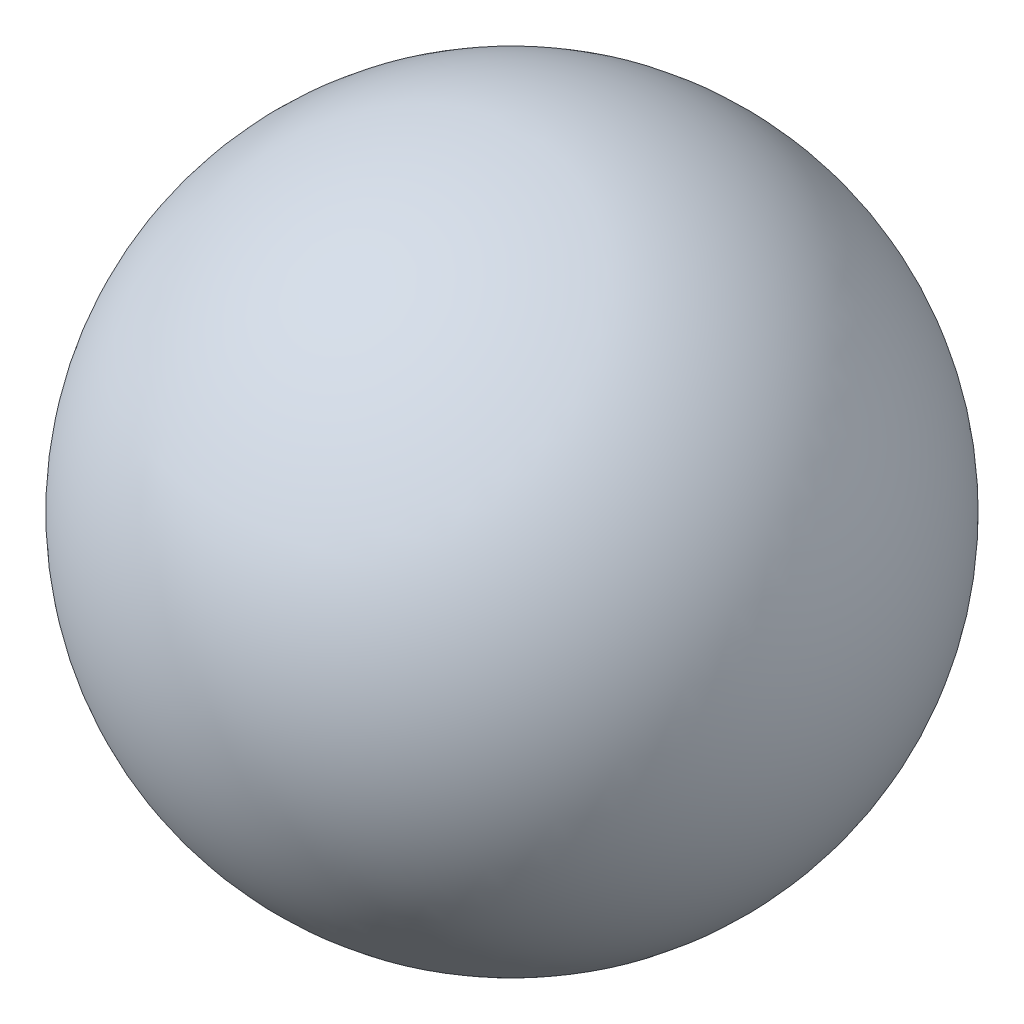
ISO-10303-21;
HEADER;
FILE_DESCRIPTION(('STEP AP214'),'2;1');
FILE_NAME('part.step','',(''),(''),'','','');
FILE_SCHEMA(('AUTOMOTIVE_DESIGN { 1 0 10303 214 1 1 1 1 }'));
ENDSEC;
DATA;
#1=APPLICATION_CONTEXT('core data for automotive mechanical design processes');
#2=APPLICATION_PROTOCOL_DEFINITION('international standard','automotive_design',2000,#1);
#3=PRODUCT_CONTEXT('',#1,'mechanical');
#4=PRODUCT('Part','Part','',(#3));
#5=PRODUCT_RELATED_PRODUCT_CATEGORY('part','',(#4));
#6=PRODUCT_DEFINITION_FORMATION('','',#4);
#7=PRODUCT_DEFINITION_CONTEXT('part definition',#1,'design');
#8=PRODUCT_DEFINITION('design','',#6,#7);
#9=PRODUCT_DEFINITION_SHAPE('','',#8);
#10=(LENGTH_UNIT() NAMED_UNIT(*) SI_UNIT(.MILLI.,.METRE.));
#11=(NAMED_UNIT(*) PLANE_ANGLE_UNIT() SI_UNIT($,.RADIAN.));
#12=(NAMED_UNIT(*) SI_UNIT($,.STERADIAN.) SOLID_ANGLE_UNIT());
#13=UNCERTAINTY_MEASURE_WITH_UNIT(LENGTH_MEASURE(1.E-05),#10,'distance_accuracy_value','');
#14=(GEOMETRIC_REPRESENTATION_CONTEXT(3) GLOBAL_UNCERTAINTY_ASSIGNED_CONTEXT((#13)) GLOBAL_UNIT_ASSIGNED_CONTEXT((#10,
#11,#12)) REPRESENTATION_CONTEXT('',''));
#15=CARTESIAN_POINT('',(0.,0.,0.));
#16=DIRECTION('',(0.,0.,1.));
#17=DIRECTION('',(1.,0.,0.));
#18=AXIS2_PLACEMENT_3D('',#15,#16,#17);
#19=CARTESIAN_POINT('',(0.,0.,0.));
#20=DIRECTION('',(0.,-1.,0.));
#21=DIRECTION('',(-1.,0.,0.));
#22=AXIS2_PLACEMENT_3D('',#19,#20,#21);
#23=SPHERICAL_SURFACE('',#22,21.5);
#24=CARTESIAN_POINT('',(0.,-21.5,0.));
#25=VERTEX_POINT('',#24);
#26=VERTEX_LOOP('',#25);
#27=FACE_BOUND('',#26,.T.);
#28=ADVANCED_FACE('F33',(#27),#23,.T.);
#29=CLOSED_SHELL('',(#28));
#30=MANIFOLD_SOLID_BREP('B2',#29);
#31=ADVANCED_BREP_SHAPE_REPRESENTATION('',(#18,#30),#14);
#32=SHAPE_DEFINITION_REPRESENTATION(#9,#31);
ENDSEC;
END-ISO-10303-21;
